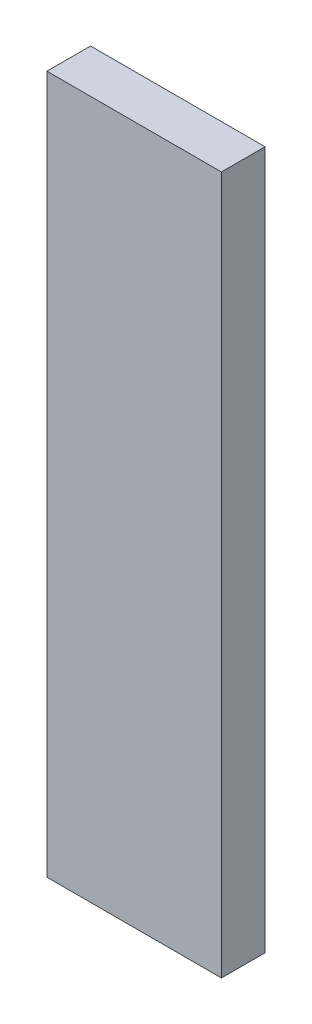
ISO-10303-21;
HEADER;
FILE_DESCRIPTION(('STEP AP214'),'2;1');
FILE_NAME('part.step','',(''),(''),'','','');
FILE_SCHEMA(('AUTOMOTIVE_DESIGN { 1 0 10303 214 1 1 1 1 }'));
ENDSEC;
DATA;
#1=APPLICATION_CONTEXT('core data for automotive mechanical design processes');
#2=APPLICATION_PROTOCOL_DEFINITION('international standard','automotive_design',2000,#1);
#3=PRODUCT_CONTEXT('',#1,'mechanical');
#4=PRODUCT('Part','Part','',(#3));
#5=PRODUCT_RELATED_PRODUCT_CATEGORY('part','',(#4));
#6=PRODUCT_DEFINITION_FORMATION('','',#4);
#7=PRODUCT_DEFINITION_CONTEXT('part definition',#1,'design');
#8=PRODUCT_DEFINITION('design','',#6,#7);
#9=PRODUCT_DEFINITION_SHAPE('','',#8);
#10=(LENGTH_UNIT() NAMED_UNIT(*) SI_UNIT(.MILLI.,.METRE.));
#11=(NAMED_UNIT(*) PLANE_ANGLE_UNIT() SI_UNIT($,.RADIAN.));
#12=(NAMED_UNIT(*) SI_UNIT($,.STERADIAN.) SOLID_ANGLE_UNIT());
#13=UNCERTAINTY_MEASURE_WITH_UNIT(LENGTH_MEASURE(1.E-05),#10,'distance_accuracy_value','');
#14=(GEOMETRIC_REPRESENTATION_CONTEXT(3) GLOBAL_UNCERTAINTY_ASSIGNED_CONTEXT((#13)) GLOBAL_UNIT_ASSIGNED_CONTEXT((#10,
#11,#12)) REPRESENTATION_CONTEXT('',''));
#15=CARTESIAN_POINT('',(0.,0.,0.));
#16=DIRECTION('',(0.,0.,1.));
#17=DIRECTION('',(1.,0.,0.));
#18=AXIS2_PLACEMENT_3D('',#15,#16,#17);
#19=CARTESIAN_POINT('',(0.,0.,12.7));
#20=DIRECTION('',(1.,0.,0.));
#21=DIRECTION('',(0.,0.,-1.));
#22=AXIS2_PLACEMENT_3D('',#19,#20,#21);
#23=PLANE('',#22);
#24=DIRECTION('',(0.,-1.,0.));
#25=VECTOR('',#24,1.);
#26=CARTESIAN_POINT('',(0.,0.,0.));
#27=LINE('',#26,#25);
#28=CARTESIAN_POINT('',(0.,203.2,0.));
#29=VERTEX_POINT('',#28);
#30=CARTESIAN_POINT('',(0.,0.,0.));
#31=VERTEX_POINT('',#30);
#32=EDGE_CURVE('E107',#29,#31,#27,.T.);
#33=ORIENTED_EDGE('',*,*,#32,.T.);
#34=DIRECTION('',(0.,0.,-1.));
#35=VECTOR('',#34,1.);
#36=CARTESIAN_POINT('',(0.,0.,12.7));
#37=LINE('',#36,#35);
#38=CARTESIAN_POINT('',(0.,0.,12.7));
#39=VERTEX_POINT('',#38);
#40=EDGE_CURVE('E11',#39,#31,#37,.T.);
#41=ORIENTED_EDGE('',*,*,#40,.F.);
#42=DIRECTION('',(0.,-1.,0.));
#43=VECTOR('',#42,1.);
#44=CARTESIAN_POINT('',(0.,0.,12.7));
#45=LINE('',#44,#43);
#46=CARTESIAN_POINT('',(0.,203.2,12.7));
#47=VERTEX_POINT('',#46);
#48=EDGE_CURVE('E91',#47,#39,#45,.T.);
#49=ORIENTED_EDGE('',*,*,#48,.F.);
#50=DIRECTION('',(0.,0.,-1.));
#51=VECTOR('',#50,1.);
#52=CARTESIAN_POINT('',(0.,203.2,12.7));
#53=LINE('',#52,#51);
#54=EDGE_CURVE('E103',#47,#29,#53,.T.);
#55=ORIENTED_EDGE('',*,*,#54,.T.);
#56=EDGE_LOOP('',(#33,#41,#49,#55));
#57=FACE_BOUND('',#56,.T.);
#58=ADVANCED_FACE('F39',(#57),#23,.F.);
#59=CARTESIAN_POINT('',(0.,0.,12.7));
#60=DIRECTION('',(0.,1.,0.));
#61=DIRECTION('',(0.,0.,1.));
#62=AXIS2_PLACEMENT_3D('',#59,#60,#61);
#63=PLANE('',#62);
#64=DIRECTION('',(1.,0.,0.));
#65=VECTOR('',#64,1.);
#66=CARTESIAN_POINT('',(0.,0.,0.));
#67=LINE('',#66,#65);
#68=CARTESIAN_POINT('',(50.8,0.,0.));
#69=VERTEX_POINT('',#68);
#70=EDGE_CURVE('E96',#31,#69,#67,.T.);
#71=ORIENTED_EDGE('',*,*,#70,.T.);
#72=DIRECTION('',(0.,0.,-1.));
#73=VECTOR('',#72,1.);
#74=CARTESIAN_POINT('',(50.8,0.,12.7));
#75=LINE('',#74,#73);
#76=CARTESIAN_POINT('',(50.8,0.,12.7));
#77=VERTEX_POINT('',#76);
#78=EDGE_CURVE('E48',#77,#69,#75,.T.);
#79=ORIENTED_EDGE('',*,*,#78,.F.);
#80=DIRECTION('',(1.,0.,0.));
#81=VECTOR('',#80,1.);
#82=CARTESIAN_POINT('',(0.,0.,12.7));
#83=LINE('',#82,#81);
#84=EDGE_CURVE('E86',#39,#77,#83,.T.);
#85=ORIENTED_EDGE('',*,*,#84,.F.);
#86=ORIENTED_EDGE('',*,*,#40,.T.);
#87=EDGE_LOOP('',(#71,#79,#85,#86));
#88=FACE_BOUND('',#87,.T.);
#89=ADVANCED_FACE('F95',(#88),#63,.F.);
#90=CARTESIAN_POINT('',(50.8,0.,12.7));
#91=DIRECTION('',(-1.,0.,0.));
#92=DIRECTION('',(0.,0.,1.));
#93=AXIS2_PLACEMENT_3D('',#90,#91,#92);
#94=PLANE('',#93);
#95=DIRECTION('',(0.,1.,0.));
#96=VECTOR('',#95,1.);
#97=CARTESIAN_POINT('',(50.8,0.,0.));
#98=LINE('',#97,#96);
#99=CARTESIAN_POINT('',(50.8,203.2,0.));
#100=VERTEX_POINT('',#99);
#101=EDGE_CURVE('E73',#69,#100,#98,.T.);
#102=ORIENTED_EDGE('',*,*,#101,.T.);
#103=DIRECTION('',(0.,0.,-1.));
#104=VECTOR('',#103,1.);
#105=CARTESIAN_POINT('',(50.8,203.2,12.7));
#106=LINE('',#105,#104);
#107=CARTESIAN_POINT('',(50.8,203.2,12.7));
#108=VERTEX_POINT('',#107);
#109=EDGE_CURVE('E98',#108,#100,#106,.T.);
#110=ORIENTED_EDGE('',*,*,#109,.F.);
#111=DIRECTION('',(0.,1.,0.));
#112=VECTOR('',#111,1.);
#113=CARTESIAN_POINT('',(50.8,0.,12.7));
#114=LINE('',#113,#112);
#115=EDGE_CURVE('E89',#77,#108,#114,.T.);
#116=ORIENTED_EDGE('',*,*,#115,.F.);
#117=ORIENTED_EDGE('',*,*,#78,.T.);
#118=EDGE_LOOP('',(#102,#110,#116,#117));
#119=FACE_BOUND('',#118,.T.);
#120=ADVANCED_FACE('F99',(#119),#94,.F.);
#121=CARTESIAN_POINT('',(0.,203.2,12.7));
#122=DIRECTION('',(0.,-1.,0.));
#123=DIRECTION('',(0.,0.,-1.));
#124=AXIS2_PLACEMENT_3D('',#121,#122,#123);
#125=PLANE('',#124);
#126=DIRECTION('',(-1.,0.,0.));
#127=VECTOR('',#126,1.);
#128=CARTESIAN_POINT('',(0.,203.2,0.));
#129=LINE('',#128,#127);
#130=EDGE_CURVE('E79',#100,#29,#129,.T.);
#131=ORIENTED_EDGE('',*,*,#130,.T.);
#132=ORIENTED_EDGE('',*,*,#54,.F.);
#133=DIRECTION('',(-1.,0.,0.));
#134=VECTOR('',#133,1.);
#135=CARTESIAN_POINT('',(0.,203.2,12.7));
#136=LINE('',#135,#134);
#137=EDGE_CURVE('E56',#108,#47,#136,.T.);
#138=ORIENTED_EDGE('',*,*,#137,.F.);
#139=ORIENTED_EDGE('',*,*,#109,.T.);
#140=EDGE_LOOP('',(#131,#132,#138,#139));
#141=FACE_BOUND('',#140,.T.);
#142=ADVANCED_FACE('F120',(#141),#125,.F.);
#143=CARTESIAN_POINT('',(0.,0.,12.7));
#144=DIRECTION('',(0.,0.,-1.));
#145=DIRECTION('',(-1.,0.,0.));
#146=AXIS2_PLACEMENT_3D('',#143,#144,#145);
#147=PLANE('',#146);
#148=ORIENTED_EDGE('',*,*,#48,.T.);
#149=ORIENTED_EDGE('',*,*,#84,.T.);
#150=ORIENTED_EDGE('',*,*,#115,.T.);
#151=ORIENTED_EDGE('',*,*,#137,.T.);
#152=EDGE_LOOP('',(#148,#149,#150,#151));
#153=FACE_BOUND('',#152,.T.);
#154=ADVANCED_FACE('F87',(#153),#147,.F.);
#155=CARTESIAN_POINT('',(0.,0.,0.));
#156=DIRECTION('',(0.,0.,-1.));
#157=DIRECTION('',(-1.,0.,0.));
#158=AXIS2_PLACEMENT_3D('',#155,#156,#157);
#159=PLANE('',#158);
#160=ORIENTED_EDGE('',*,*,#32,.F.);
#161=ORIENTED_EDGE('',*,*,#130,.F.);
#162=ORIENTED_EDGE('',*,*,#101,.F.);
#163=ORIENTED_EDGE('',*,*,#70,.F.);
#164=EDGE_LOOP('',(#160,#161,#162,#163));
#165=FACE_BOUND('',#164,.T.);
#166=ADVANCED_FACE('F123',(#165),#159,.T.);
#167=CLOSED_SHELL('',(#58,#89,#120,#142,#154,#166));
#168=MANIFOLD_SOLID_BREP('B2',#167);
#169=ADVANCED_BREP_SHAPE_REPRESENTATION('',(#18,#168),#14);
#170=SHAPE_DEFINITION_REPRESENTATION(#9,#169);
ENDSEC;
END-ISO-10303-21;
